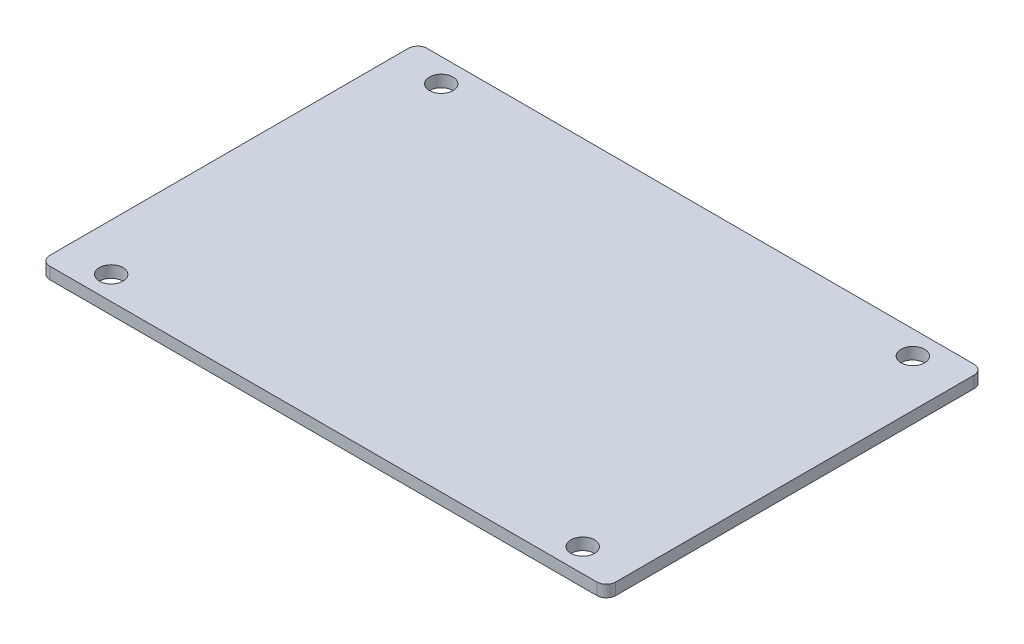
ISO-10303-21;
HEADER;
FILE_DESCRIPTION(('STEP AP214'),'2;1');
FILE_NAME('part.step','',(''),(''),'','','');
FILE_SCHEMA(('AUTOMOTIVE_DESIGN { 1 0 10303 214 1 1 1 1 }'));
ENDSEC;
DATA;
#1=APPLICATION_CONTEXT('core data for automotive mechanical design processes');
#2=APPLICATION_PROTOCOL_DEFINITION('international standard','automotive_design',2000,#1);
#3=PRODUCT_CONTEXT('',#1,'mechanical');
#4=PRODUCT('Part','Part','',(#3));
#5=PRODUCT_RELATED_PRODUCT_CATEGORY('part','',(#4));
#6=PRODUCT_DEFINITION_FORMATION('','',#4);
#7=PRODUCT_DEFINITION_CONTEXT('part definition',#1,'design');
#8=PRODUCT_DEFINITION('design','',#6,#7);
#9=PRODUCT_DEFINITION_SHAPE('','',#8);
#10=(LENGTH_UNIT() NAMED_UNIT(*) SI_UNIT(.MILLI.,.METRE.));
#11=(NAMED_UNIT(*) PLANE_ANGLE_UNIT() SI_UNIT($,.RADIAN.));
#12=(NAMED_UNIT(*) SI_UNIT($,.STERADIAN.) SOLID_ANGLE_UNIT());
#13=UNCERTAINTY_MEASURE_WITH_UNIT(LENGTH_MEASURE(1.E-05),#10,'distance_accuracy_value','');
#14=(GEOMETRIC_REPRESENTATION_CONTEXT(3) GLOBAL_UNCERTAINTY_ASSIGNED_CONTEXT((#13)) GLOBAL_UNIT_ASSIGNED_CONTEXT((#10,
#11,#12)) REPRESENTATION_CONTEXT('',''));
#15=CARTESIAN_POINT('',(0.,0.,0.));
#16=DIRECTION('',(0.,0.,1.));
#17=DIRECTION('',(1.,0.,0.));
#18=AXIS2_PLACEMENT_3D('',#15,#16,#17);
#19=CARTESIAN_POINT('',(-64.8653268765134,3.175,46.0459564164649));
#20=DIRECTION('',(0.,1.,0.));
#21=DIRECTION('',(0.,0.,1.));
#22=AXIS2_PLACEMENT_3D('',#19,#20,#21);
#23=PLANE('',#22);
#24=CARTESIAN_POINT('',(-54.7053268765133,3.175,42.2359564164649));
#25=DIRECTION('',(0.,-1.,0.));
#26=DIRECTION('',(0.,0.,-1.));
#27=AXIS2_PLACEMENT_3D('',#24,#25,#26);
#28=CIRCLE('',#27,3.175);
#29=CARTESIAN_POINT('',(-54.7053268765133,3.175,39.0609564164649));
#30=VERTEX_POINT('',#29);
#31=EDGE_CURVE('E220',#30,#30,#28,.T.);
#32=ORIENTED_EDGE('',*,*,#31,.T.);
#33=EDGE_LOOP('',(#32));
#34=FACE_BOUND('',#33,.T.);
#35=CARTESIAN_POINT('',(-64.8653268765134,3.175,46.0459564164649));
#36=DIRECTION('',(0.,1.,0.));
#37=DIRECTION('',(0.,0.,1.));
#38=AXIS2_PLACEMENT_3D('',#35,#36,#37);
#39=CIRCLE('',#38,2.54);
#40=CARTESIAN_POINT('',(-67.4053268765134,3.175,46.0459564164649));
#41=VERTEX_POINT('',#40);
#42=CARTESIAN_POINT('',(-64.8653268765133,3.175,48.5859564164649));
#43=VERTEX_POINT('',#42);
#44=EDGE_CURVE('E168',#41,#43,#39,.T.);
#45=ORIENTED_EDGE('',*,*,#44,.T.);
#46=DIRECTION('',(1.,0.,0.));
#47=VECTOR('',#46,1.);
#48=CARTESIAN_POINT('',(-64.8653268765133,3.175,48.5859564164649));
#49=LINE('',#48,#47);
#50=CARTESIAN_POINT('',(82.4546731234866,3.175,48.5859564164649));
#51=VERTEX_POINT('',#50);
#52=EDGE_CURVE('E104',#43,#51,#49,.T.);
#53=ORIENTED_EDGE('',*,*,#52,.T.);
#54=CARTESIAN_POINT('',(82.4546731234867,3.175,46.0459564164649));
#55=DIRECTION('',(0.,1.,0.));
#56=DIRECTION('',(0.,0.,1.));
#57=AXIS2_PLACEMENT_3D('',#54,#55,#56);
#58=CIRCLE('',#57,2.54);
#59=CARTESIAN_POINT('',(84.9946731234867,3.175,46.0459564164649));
#60=VERTEX_POINT('',#59);
#61=EDGE_CURVE('E189',#51,#60,#58,.T.);
#62=ORIENTED_EDGE('',*,*,#61,.T.);
#63=DIRECTION('',(0.,0.,-1.));
#64=VECTOR('',#63,1.);
#65=CARTESIAN_POINT('',(84.9946731234867,3.175,-50.4740435835351));
#66=LINE('',#65,#64);
#67=CARTESIAN_POINT('',(84.9946731234867,3.175,-50.4740435835351));
#68=VERTEX_POINT('',#67);
#69=EDGE_CURVE('E203',#60,#68,#66,.T.);
#70=ORIENTED_EDGE('',*,*,#69,.T.);
#71=CARTESIAN_POINT('',(82.4546731234867,3.175,-50.4740435835351));
#72=DIRECTION('',(0.,1.,0.));
#73=DIRECTION('',(0.,0.,-1.));
#74=AXIS2_PLACEMENT_3D('',#71,#72,#73);
#75=CIRCLE('',#74,2.54);
#76=CARTESIAN_POINT('',(82.4546731234866,3.175,-53.0140435835351));
#77=VERTEX_POINT('',#76);
#78=EDGE_CURVE('E123',#68,#77,#75,.T.);
#79=ORIENTED_EDGE('',*,*,#78,.T.);
#80=DIRECTION('',(-1.,0.,0.));
#81=VECTOR('',#80,1.);
#82=CARTESIAN_POINT('',(-64.8653268765133,3.175,-53.0140435835351));
#83=LINE('',#82,#81);
#84=CARTESIAN_POINT('',(-64.8653268765133,3.175,-53.0140435835351));
#85=VERTEX_POINT('',#84);
#86=EDGE_CURVE('E117',#77,#85,#83,.T.);
#87=ORIENTED_EDGE('',*,*,#86,.T.);
#88=CARTESIAN_POINT('',(-64.8653268765134,3.175,-50.4740435835351));
#89=DIRECTION('',(0.,1.,0.));
#90=DIRECTION('',(0.,0.,1.));
#91=AXIS2_PLACEMENT_3D('',#88,#89,#90);
#92=CIRCLE('',#91,2.54);
#93=CARTESIAN_POINT('',(-67.4053268765134,3.175,-50.4740435835351));
#94=VERTEX_POINT('',#93);
#95=EDGE_CURVE('E121',#85,#94,#92,.T.);
#96=ORIENTED_EDGE('',*,*,#95,.T.);
#97=DIRECTION('',(0.,0.,1.));
#98=VECTOR('',#97,1.);
#99=CARTESIAN_POINT('',(-67.4053268765134,3.175,-50.4740435835351));
#100=LINE('',#99,#98);
#101=EDGE_CURVE('E61',#94,#41,#100,.T.);
#102=ORIENTED_EDGE('',*,*,#101,.T.);
#103=EDGE_LOOP('',(#45,#53,#62,#70,#79,#87,#96,#102));
#104=FACE_BOUND('',#103,.T.);
#105=CARTESIAN_POINT('',(-54.7053268765133,3.175,-46.6640435835351));
#106=DIRECTION('',(0.,-1.,0.));
#107=DIRECTION('',(0.,0.,-1.));
#108=AXIS2_PLACEMENT_3D('',#105,#106,#107);
#109=CIRCLE('',#108,3.175);
#110=CARTESIAN_POINT('',(-54.7053268765133,3.175,-49.8390435835351));
#111=VERTEX_POINT('',#110);
#112=EDGE_CURVE('E150',#111,#111,#109,.T.);
#113=ORIENTED_EDGE('',*,*,#112,.T.);
#114=EDGE_LOOP('',(#113));
#115=FACE_BOUND('',#114,.T.);
#116=CARTESIAN_POINT('',(72.2946731234867,3.175,42.2359564164649));
#117=DIRECTION('',(0.,-1.,0.));
#118=DIRECTION('',(0.,0.,-1.));
#119=AXIS2_PLACEMENT_3D('',#116,#117,#118);
#120=CIRCLE('',#119,3.175);
#121=CARTESIAN_POINT('',(72.2946731234867,3.175,39.0609564164649));
#122=VERTEX_POINT('',#121);
#123=EDGE_CURVE('E228',#122,#122,#120,.T.);
#124=ORIENTED_EDGE('',*,*,#123,.T.);
#125=EDGE_LOOP('',(#124));
#126=FACE_BOUND('',#125,.T.);
#127=CARTESIAN_POINT('',(72.2946731234867,3.175,-46.6640435835351));
#128=DIRECTION('',(0.,-1.,0.));
#129=DIRECTION('',(0.,0.,-1.));
#130=AXIS2_PLACEMENT_3D('',#127,#128,#129);
#131=CIRCLE('',#130,3.175);
#132=CARTESIAN_POINT('',(72.2946731234867,3.175,-49.8390435835351));
#133=VERTEX_POINT('',#132);
#134=EDGE_CURVE('E236',#133,#133,#131,.T.);
#135=ORIENTED_EDGE('',*,*,#134,.T.);
#136=EDGE_LOOP('',(#135));
#137=FACE_BOUND('',#136,.T.);
#138=ADVANCED_FACE('F43',(#34,#104,#115,#126,#137),#23,.T.);
#139=CARTESIAN_POINT('',(-64.8653268765134,0.,46.0459564164649));
#140=DIRECTION('',(0.,1.,0.));
#141=DIRECTION('',(0.,0.,1.));
#142=AXIS2_PLACEMENT_3D('',#139,#140,#141);
#143=PLANE('',#142);
#144=CARTESIAN_POINT('',(72.2946731234867,0.,-46.6640435835351));
#145=DIRECTION('',(0.,-1.,0.));
#146=DIRECTION('',(0.,0.,-1.));
#147=AXIS2_PLACEMENT_3D('',#144,#145,#146);
#148=CIRCLE('',#147,3.175);
#149=CARTESIAN_POINT('',(72.2946731234867,0.,-49.8390435835351));
#150=VERTEX_POINT('',#149);
#151=EDGE_CURVE('E240',#150,#150,#148,.T.);
#152=ORIENTED_EDGE('',*,*,#151,.F.);
#153=EDGE_LOOP('',(#152));
#154=FACE_BOUND('',#153,.T.);
#155=CARTESIAN_POINT('',(-54.7053268765133,0.,-46.6640435835351));
#156=DIRECTION('',(0.,-1.,0.));
#157=DIRECTION('',(0.,0.,-1.));
#158=AXIS2_PLACEMENT_3D('',#155,#156,#157);
#159=CIRCLE('',#158,3.175);
#160=CARTESIAN_POINT('',(-54.7053268765133,0.,-49.8390435835351));
#161=VERTEX_POINT('',#160);
#162=EDGE_CURVE('E216',#161,#161,#159,.T.);
#163=ORIENTED_EDGE('',*,*,#162,.F.);
#164=EDGE_LOOP('',(#163));
#165=FACE_BOUND('',#164,.T.);
#166=CARTESIAN_POINT('',(-64.8653268765134,0.,46.0459564164649));
#167=DIRECTION('',(0.,1.,0.));
#168=DIRECTION('',(0.,0.,1.));
#169=AXIS2_PLACEMENT_3D('',#166,#167,#168);
#170=CIRCLE('',#169,2.54);
#171=CARTESIAN_POINT('',(-67.4053268765134,0.,46.0459564164649));
#172=VERTEX_POINT('',#171);
#173=CARTESIAN_POINT('',(-64.8653268765133,0.,48.5859564164649));
#174=VERTEX_POINT('',#173);
#175=EDGE_CURVE('E145',#172,#174,#170,.T.);
#176=ORIENTED_EDGE('',*,*,#175,.F.);
#177=DIRECTION('',(0.,0.,1.));
#178=VECTOR('',#177,1.);
#179=CARTESIAN_POINT('',(-67.4053268765134,0.,-50.4740435835351));
#180=LINE('',#179,#178);
#181=CARTESIAN_POINT('',(-67.4053268765134,0.,-50.4740435835351));
#182=VERTEX_POINT('',#181);
#183=EDGE_CURVE('E96',#182,#172,#180,.T.);
#184=ORIENTED_EDGE('',*,*,#183,.F.);
#185=CARTESIAN_POINT('',(-64.8653268765134,0.,-50.4740435835351));
#186=DIRECTION('',(0.,1.,0.));
#187=DIRECTION('',(0.,0.,1.));
#188=AXIS2_PLACEMENT_3D('',#185,#186,#187);
#189=CIRCLE('',#188,2.54);
#190=CARTESIAN_POINT('',(-64.8653268765133,0.,-53.0140435835351));
#191=VERTEX_POINT('',#190);
#192=EDGE_CURVE('E90',#191,#182,#189,.T.);
#193=ORIENTED_EDGE('',*,*,#192,.F.);
#194=DIRECTION('',(-1.,0.,0.));
#195=VECTOR('',#194,1.);
#196=CARTESIAN_POINT('',(-64.8653268765133,0.,-53.0140435835351));
#197=LINE('',#196,#195);
#198=CARTESIAN_POINT('',(82.4546731234866,0.,-53.0140435835351));
#199=VERTEX_POINT('',#198);
#200=EDGE_CURVE('E132',#199,#191,#197,.T.);
#201=ORIENTED_EDGE('',*,*,#200,.F.);
#202=CARTESIAN_POINT('',(82.4546731234867,0.,-50.4740435835351));
#203=DIRECTION('',(0.,1.,0.));
#204=DIRECTION('',(0.,0.,-1.));
#205=AXIS2_PLACEMENT_3D('',#202,#203,#204);
#206=CIRCLE('',#205,2.54);
#207=CARTESIAN_POINT('',(84.9946731234867,0.,-50.4740435835351));
#208=VERTEX_POINT('',#207);
#209=EDGE_CURVE('E159',#208,#199,#206,.T.);
#210=ORIENTED_EDGE('',*,*,#209,.F.);
#211=DIRECTION('',(0.,0.,-1.));
#212=VECTOR('',#211,1.);
#213=CARTESIAN_POINT('',(84.9946731234867,0.,-50.4740435835351));
#214=LINE('',#213,#212);
#215=CARTESIAN_POINT('',(84.9946731234867,0.,46.0459564164649));
#216=VERTEX_POINT('',#215);
#217=EDGE_CURVE('E156',#216,#208,#214,.T.);
#218=ORIENTED_EDGE('',*,*,#217,.F.);
#219=CARTESIAN_POINT('',(82.4546731234867,0.,46.0459564164649));
#220=DIRECTION('',(0.,1.,0.));
#221=DIRECTION('',(0.,0.,1.));
#222=AXIS2_PLACEMENT_3D('',#219,#220,#221);
#223=CIRCLE('',#222,2.54);
#224=CARTESIAN_POINT('',(82.4546731234866,0.,48.5859564164649));
#225=VERTEX_POINT('',#224);
#226=EDGE_CURVE('E153',#225,#216,#223,.T.);
#227=ORIENTED_EDGE('',*,*,#226,.F.);
#228=DIRECTION('',(1.,0.,0.));
#229=VECTOR('',#228,1.);
#230=CARTESIAN_POINT('',(-64.8653268765133,0.,48.5859564164649));
#231=LINE('',#230,#229);
#232=EDGE_CURVE('E149',#174,#225,#231,.T.);
#233=ORIENTED_EDGE('',*,*,#232,.F.);
#234=EDGE_LOOP('',(#176,#184,#193,#201,#210,#218,#227,#233));
#235=FACE_BOUND('',#234,.T.);
#236=CARTESIAN_POINT('',(-54.7053268765133,0.,42.2359564164649));
#237=DIRECTION('',(0.,-1.,0.));
#238=DIRECTION('',(0.,0.,-1.));
#239=AXIS2_PLACEMENT_3D('',#236,#237,#238);
#240=CIRCLE('',#239,3.175);
#241=CARTESIAN_POINT('',(-54.7053268765133,0.,39.0609564164649));
#242=VERTEX_POINT('',#241);
#243=EDGE_CURVE('E224',#242,#242,#240,.T.);
#244=ORIENTED_EDGE('',*,*,#243,.F.);
#245=EDGE_LOOP('',(#244));
#246=FACE_BOUND('',#245,.T.);
#247=CARTESIAN_POINT('',(72.2946731234867,0.,42.2359564164649));
#248=DIRECTION('',(0.,-1.,0.));
#249=DIRECTION('',(0.,0.,-1.));
#250=AXIS2_PLACEMENT_3D('',#247,#248,#249);
#251=CIRCLE('',#250,3.175);
#252=CARTESIAN_POINT('',(72.2946731234867,0.,39.0609564164649));
#253=VERTEX_POINT('',#252);
#254=EDGE_CURVE('E232',#253,#253,#251,.T.);
#255=ORIENTED_EDGE('',*,*,#254,.F.);
#256=EDGE_LOOP('',(#255));
#257=FACE_BOUND('',#256,.T.);
#258=ADVANCED_FACE('F193',(#154,#165,#235,#246,#257),#143,.F.);
#259=CARTESIAN_POINT('',(-64.8653268765134,3.175,46.0459564164649));
#260=DIRECTION('',(0.,-1.,0.));
#261=DIRECTION('',(0.,0.,-1.));
#262=AXIS2_PLACEMENT_3D('',#259,#260,#261);
#263=CYLINDRICAL_SURFACE('',#262,2.54);
#264=ORIENTED_EDGE('',*,*,#175,.T.);
#265=DIRECTION('',(0.,-1.,0.));
#266=VECTOR('',#265,1.);
#267=CARTESIAN_POINT('',(-64.8653268765133,3.175,48.5859564164649));
#268=LINE('',#267,#266);
#269=EDGE_CURVE('E11',#43,#174,#268,.T.);
#270=ORIENTED_EDGE('',*,*,#269,.F.);
#271=ORIENTED_EDGE('',*,*,#44,.F.);
#272=DIRECTION('',(0.,-1.,0.));
#273=VECTOR('',#272,1.);
#274=CARTESIAN_POINT('',(-67.4053268765134,3.175,46.0459564164649));
#275=LINE('',#274,#273);
#276=EDGE_CURVE('E141',#41,#172,#275,.T.);
#277=ORIENTED_EDGE('',*,*,#276,.T.);
#278=EDGE_LOOP('',(#264,#270,#271,#277));
#279=FACE_BOUND('',#278,.T.);
#280=ADVANCED_FACE('F45',(#279),#263,.T.);
#281=CARTESIAN_POINT('',(-64.8653268765133,3.175,48.5859564164649));
#282=DIRECTION('',(0.,0.,-1.));
#283=DIRECTION('',(-1.,0.,0.));
#284=AXIS2_PLACEMENT_3D('',#281,#282,#283);
#285=PLANE('',#284);
#286=ORIENTED_EDGE('',*,*,#232,.T.);
#287=DIRECTION('',(0.,-1.,0.));
#288=VECTOR('',#287,1.);
#289=CARTESIAN_POINT('',(82.4546731234866,3.175,48.5859564164649));
#290=LINE('',#289,#288);
#291=EDGE_CURVE('E53',#51,#225,#290,.T.);
#292=ORIENTED_EDGE('',*,*,#291,.F.);
#293=ORIENTED_EDGE('',*,*,#52,.F.);
#294=ORIENTED_EDGE('',*,*,#269,.T.);
#295=EDGE_LOOP('',(#286,#292,#293,#294));
#296=FACE_BOUND('',#295,.T.);
#297=ADVANCED_FACE('F282',(#296),#285,.F.);
#298=CARTESIAN_POINT('',(82.4546731234867,3.175,46.0459564164649));
#299=DIRECTION('',(0.,-1.,0.));
#300=DIRECTION('',(0.,0.,-1.));
#301=AXIS2_PLACEMENT_3D('',#298,#299,#300);
#302=CYLINDRICAL_SURFACE('',#301,2.54);
#303=ORIENTED_EDGE('',*,*,#226,.T.);
#304=DIRECTION('',(0.,-1.,0.));
#305=VECTOR('',#304,1.);
#306=CARTESIAN_POINT('',(84.9946731234867,3.175,46.0459564164649));
#307=LINE('',#306,#305);
#308=EDGE_CURVE('E179',#60,#216,#307,.T.);
#309=ORIENTED_EDGE('',*,*,#308,.F.);
#310=ORIENTED_EDGE('',*,*,#61,.F.);
#311=ORIENTED_EDGE('',*,*,#291,.T.);
#312=EDGE_LOOP('',(#303,#309,#310,#311));
#313=FACE_BOUND('',#312,.T.);
#314=ADVANCED_FACE('F187',(#313),#302,.T.);
#315=CARTESIAN_POINT('',(84.9946731234867,3.175,-50.4740435835351));
#316=DIRECTION('',(-1.,0.,0.));
#317=DIRECTION('',(0.,0.,1.));
#318=AXIS2_PLACEMENT_3D('',#315,#316,#317);
#319=PLANE('',#318);
#320=ORIENTED_EDGE('',*,*,#217,.T.);
#321=DIRECTION('',(0.,-1.,0.));
#322=VECTOR('',#321,1.);
#323=CARTESIAN_POINT('',(84.9946731234867,3.175,-50.4740435835351));
#324=LINE('',#323,#322);
#325=EDGE_CURVE('E175',#68,#208,#324,.T.);
#326=ORIENTED_EDGE('',*,*,#325,.F.);
#327=ORIENTED_EDGE('',*,*,#69,.F.);
#328=ORIENTED_EDGE('',*,*,#308,.T.);
#329=EDGE_LOOP('',(#320,#326,#327,#328));
#330=FACE_BOUND('',#329,.T.);
#331=ADVANCED_FACE('F198',(#330),#319,.F.);
#332=CARTESIAN_POINT('',(82.4546731234867,3.175,-50.4740435835351));
#333=DIRECTION('',(0.,-1.,0.));
#334=DIRECTION('',(0.,0.,-1.));
#335=AXIS2_PLACEMENT_3D('',#332,#333,#334);
#336=CYLINDRICAL_SURFACE('',#335,2.54);
#337=ORIENTED_EDGE('',*,*,#209,.T.);
#338=DIRECTION('',(0.,-1.,0.));
#339=VECTOR('',#338,1.);
#340=CARTESIAN_POINT('',(82.4546731234866,3.175,-53.0140435835351));
#341=LINE('',#340,#339);
#342=EDGE_CURVE('E134',#77,#199,#341,.T.);
#343=ORIENTED_EDGE('',*,*,#342,.F.);
#344=ORIENTED_EDGE('',*,*,#78,.F.);
#345=ORIENTED_EDGE('',*,*,#325,.T.);
#346=EDGE_LOOP('',(#337,#343,#344,#345));
#347=FACE_BOUND('',#346,.T.);
#348=ADVANCED_FACE('F201',(#347),#336,.T.);
#349=CARTESIAN_POINT('',(-64.8653268765133,3.175,-53.0140435835351));
#350=DIRECTION('',(0.,0.,1.));
#351=DIRECTION('',(1.,0.,0.));
#352=AXIS2_PLACEMENT_3D('',#349,#350,#351);
#353=PLANE('',#352);
#354=ORIENTED_EDGE('',*,*,#200,.T.);
#355=DIRECTION('',(0.,-1.,0.));
#356=VECTOR('',#355,1.);
#357=CARTESIAN_POINT('',(-64.8653268765133,3.175,-53.0140435835351));
#358=LINE('',#357,#356);
#359=EDGE_CURVE('E129',#85,#191,#358,.T.);
#360=ORIENTED_EDGE('',*,*,#359,.F.);
#361=ORIENTED_EDGE('',*,*,#86,.F.);
#362=ORIENTED_EDGE('',*,*,#342,.T.);
#363=EDGE_LOOP('',(#354,#360,#361,#362));
#364=FACE_BOUND('',#363,.T.);
#365=ADVANCED_FACE('F130',(#364),#353,.F.);
#366=CARTESIAN_POINT('',(-64.8653268765134,3.175,-50.4740435835351));
#367=DIRECTION('',(0.,-1.,0.));
#368=DIRECTION('',(0.,0.,-1.));
#369=AXIS2_PLACEMENT_3D('',#366,#367,#368);
#370=CYLINDRICAL_SURFACE('',#369,2.54);
#371=ORIENTED_EDGE('',*,*,#192,.T.);
#372=DIRECTION('',(0.,-1.,0.));
#373=VECTOR('',#372,1.);
#374=CARTESIAN_POINT('',(-67.4053268765134,3.175,-50.4740435835351));
#375=LINE('',#374,#373);
#376=EDGE_CURVE('E135',#94,#182,#375,.T.);
#377=ORIENTED_EDGE('',*,*,#376,.F.);
#378=ORIENTED_EDGE('',*,*,#95,.F.);
#379=ORIENTED_EDGE('',*,*,#359,.T.);
#380=EDGE_LOOP('',(#371,#377,#378,#379));
#381=FACE_BOUND('',#380,.T.);
#382=ADVANCED_FACE('F137',(#381),#370,.T.);
#383=CARTESIAN_POINT('',(-67.4053268765134,3.175,-50.4740435835351));
#384=DIRECTION('',(1.,0.,0.));
#385=DIRECTION('',(0.,0.,-1.));
#386=AXIS2_PLACEMENT_3D('',#383,#384,#385);
#387=PLANE('',#386);
#388=ORIENTED_EDGE('',*,*,#183,.T.);
#389=ORIENTED_EDGE('',*,*,#276,.F.);
#390=ORIENTED_EDGE('',*,*,#101,.F.);
#391=ORIENTED_EDGE('',*,*,#376,.T.);
#392=EDGE_LOOP('',(#388,#389,#390,#391));
#393=FACE_BOUND('',#392,.T.);
#394=ADVANCED_FACE('F255',(#393),#387,.F.);
#395=CARTESIAN_POINT('',(-54.7053268765133,0.,-46.6640435835351));
#396=DIRECTION('',(0.,-1.,0.));
#397=DIRECTION('',(0.,0.,-1.));
#398=AXIS2_PLACEMENT_3D('',#395,#396,#397);
#399=CYLINDRICAL_SURFACE('',#398,3.175);
#400=ORIENTED_EDGE('',*,*,#112,.F.);
#401=EDGE_LOOP('',(#400));
#402=FACE_BOUND('',#401,.T.);
#403=ORIENTED_EDGE('',*,*,#162,.T.);
#404=EDGE_LOOP('',(#403));
#405=FACE_BOUND('',#404,.T.);
#406=ADVANCED_FACE('F252',(#402,#405),#399,.F.);
#407=CARTESIAN_POINT('',(-54.7053268765133,0.,42.2359564164649));
#408=DIRECTION('',(0.,-1.,0.));
#409=DIRECTION('',(0.,0.,-1.));
#410=AXIS2_PLACEMENT_3D('',#407,#408,#409);
#411=CYLINDRICAL_SURFACE('',#410,3.175);
#412=ORIENTED_EDGE('',*,*,#31,.F.);
#413=EDGE_LOOP('',(#412));
#414=FACE_BOUND('',#413,.T.);
#415=ORIENTED_EDGE('',*,*,#243,.T.);
#416=EDGE_LOOP('',(#415));
#417=FACE_BOUND('',#416,.T.);
#418=ADVANCED_FACE('F254',(#414,#417),#411,.F.);
#419=CARTESIAN_POINT('',(72.2946731234867,0.,42.2359564164649));
#420=DIRECTION('',(0.,-1.,0.));
#421=DIRECTION('',(0.,0.,-1.));
#422=AXIS2_PLACEMENT_3D('',#419,#420,#421);
#423=CYLINDRICAL_SURFACE('',#422,3.175);
#424=ORIENTED_EDGE('',*,*,#123,.F.);
#425=EDGE_LOOP('',(#424));
#426=FACE_BOUND('',#425,.T.);
#427=ORIENTED_EDGE('',*,*,#254,.T.);
#428=EDGE_LOOP('',(#427));
#429=FACE_BOUND('',#428,.T.);
#430=ADVANCED_FACE('F262',(#426,#429),#423,.F.);
#431=CARTESIAN_POINT('',(72.2946731234867,0.,-46.6640435835351));
#432=DIRECTION('',(0.,-1.,0.));
#433=DIRECTION('',(0.,0.,-1.));
#434=AXIS2_PLACEMENT_3D('',#431,#432,#433);
#435=CYLINDRICAL_SURFACE('',#434,3.175);
#436=ORIENTED_EDGE('',*,*,#134,.F.);
#437=EDGE_LOOP('',(#436));
#438=FACE_BOUND('',#437,.T.);
#439=ORIENTED_EDGE('',*,*,#151,.T.);
#440=EDGE_LOOP('',(#439));
#441=FACE_BOUND('',#440,.T.);
#442=ADVANCED_FACE('F245',(#438,#441),#435,.F.);
#443=CLOSED_SHELL('',(#138,#258,#280,#297,#314,#331,#348,#365,#382,#394,#406,#418,#430,#442));
#444=MANIFOLD_SOLID_BREP('B2',#443);
#445=ADVANCED_BREP_SHAPE_REPRESENTATION('',(#18,#444),#14);
#446=SHAPE_DEFINITION_REPRESENTATION(#9,#445);
ENDSEC;
END-ISO-10303-21;
